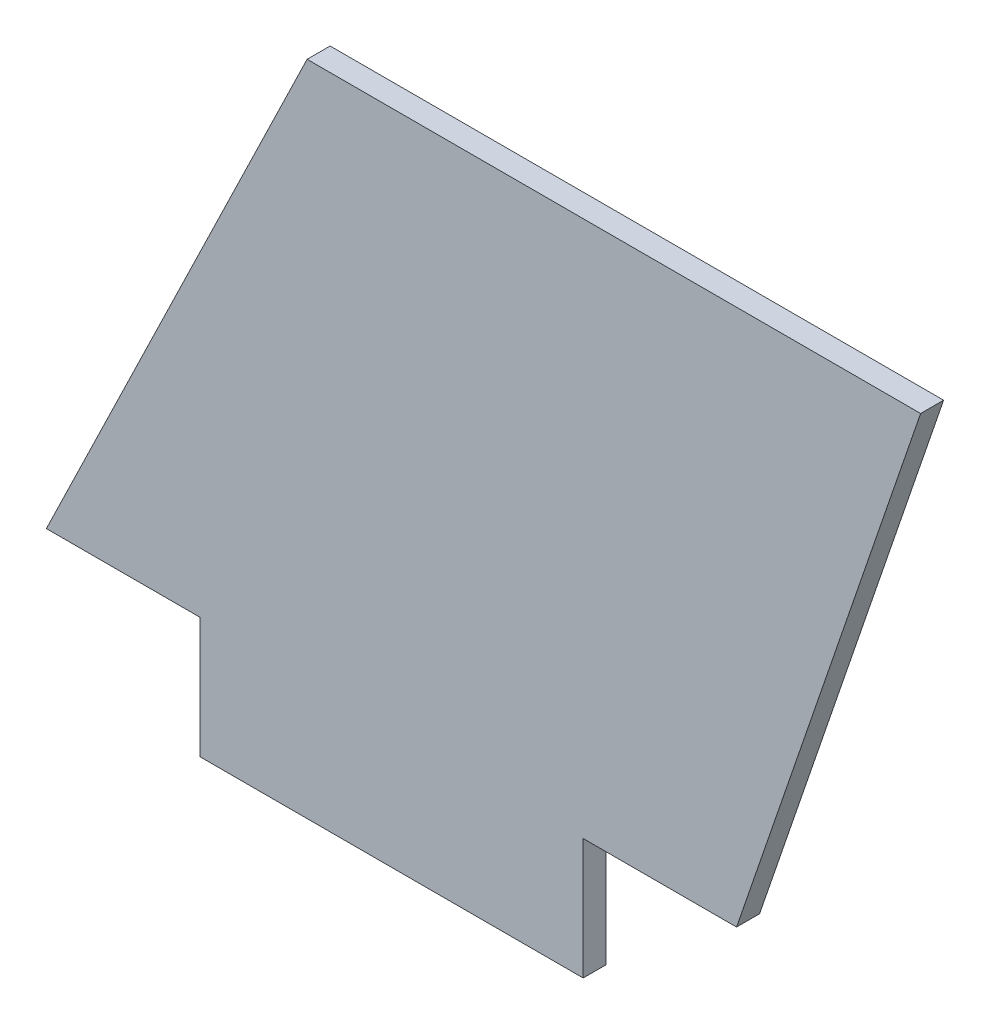
ISO-10303-21;
HEADER;
FILE_DESCRIPTION(('STEP AP214'),'2;1');
FILE_NAME('part.step','',(''),(''),'','','');
FILE_SCHEMA(('AUTOMOTIVE_DESIGN { 1 0 10303 214 1 1 1 1 }'));
ENDSEC;
DATA;
#1=APPLICATION_CONTEXT('core data for automotive mechanical design processes');
#2=APPLICATION_PROTOCOL_DEFINITION('international standard','automotive_design',2000,#1);
#3=PRODUCT_CONTEXT('',#1,'mechanical');
#4=PRODUCT('Part','Part','',(#3));
#5=PRODUCT_RELATED_PRODUCT_CATEGORY('part','',(#4));
#6=PRODUCT_DEFINITION_FORMATION('','',#4);
#7=PRODUCT_DEFINITION_CONTEXT('part definition',#1,'design');
#8=PRODUCT_DEFINITION('design','',#6,#7);
#9=PRODUCT_DEFINITION_SHAPE('','',#8);
#10=(LENGTH_UNIT() NAMED_UNIT(*) SI_UNIT(.MILLI.,.METRE.));
#11=(NAMED_UNIT(*) PLANE_ANGLE_UNIT() SI_UNIT($,.RADIAN.));
#12=(NAMED_UNIT(*) SI_UNIT($,.STERADIAN.) SOLID_ANGLE_UNIT());
#13=UNCERTAINTY_MEASURE_WITH_UNIT(LENGTH_MEASURE(1.E-05),#10,'distance_accuracy_value','');
#14=(GEOMETRIC_REPRESENTATION_CONTEXT(3) GLOBAL_UNCERTAINTY_ASSIGNED_CONTEXT((#13)) GLOBAL_UNIT_ASSIGNED_CONTEXT((#10,
#11,#12)) REPRESENTATION_CONTEXT('',''));
#15=CARTESIAN_POINT('',(0.,0.,0.));
#16=DIRECTION('',(0.,0.,1.));
#17=DIRECTION('',(1.,0.,0.));
#18=AXIS2_PLACEMENT_3D('',#15,#16,#17);
#19=CARTESIAN_POINT('',(17.,35.,1.5));
#20=DIRECTION('',(0.899508158575998,-0.436903962736913,0.));
#21=DIRECTION('',(0.436903962736913,0.899508158575998,0.));
#22=AXIS2_PLACEMENT_3D('',#19,#20,#21);
#23=PLANE('',#22);
#24=DIRECTION('',(-0.436903962736913,-0.899508158575998,0.));
#25=VECTOR('',#24,1.);
#26=CARTESIAN_POINT('',(17.,35.,0.));
#27=LINE('',#26,#25);
#28=CARTESIAN_POINT('',(17.,35.,0.));
#29=VERTEX_POINT('',#28);
#30=CARTESIAN_POINT('',(0.,0.,0.));
#31=VERTEX_POINT('',#30);
#32=EDGE_CURVE('E129',#29,#31,#27,.T.);
#33=ORIENTED_EDGE('',*,*,#32,.T.);
#34=DIRECTION('',(0.,0.,-1.));
#35=VECTOR('',#34,1.);
#36=CARTESIAN_POINT('',(0.,0.,1.5));
#37=LINE('',#36,#35);
#38=CARTESIAN_POINT('',(0.,0.,1.5));
#39=VERTEX_POINT('',#38);
#40=EDGE_CURVE('E11',#39,#31,#37,.T.);
#41=ORIENTED_EDGE('',*,*,#40,.F.);
#42=DIRECTION('',(-0.436903962736913,-0.899508158575998,0.));
#43=VECTOR('',#42,1.);
#44=CARTESIAN_POINT('',(17.,35.,1.5));
#45=LINE('',#44,#43);
#46=CARTESIAN_POINT('',(17.,35.,1.5));
#47=VERTEX_POINT('',#46);
#48=EDGE_CURVE('E143',#47,#39,#45,.T.);
#49=ORIENTED_EDGE('',*,*,#48,.F.);
#50=DIRECTION('',(0.,0.,-1.));
#51=VECTOR('',#50,1.);
#52=CARTESIAN_POINT('',(17.,35.,1.5));
#53=LINE('',#52,#51);
#54=EDGE_CURVE('E125',#47,#29,#53,.T.);
#55=ORIENTED_EDGE('',*,*,#54,.T.);
#56=EDGE_LOOP('',(#33,#41,#49,#55));
#57=FACE_BOUND('',#56,.T.);
#58=ADVANCED_FACE('F33',(#57),#23,.F.);
#59=CARTESIAN_POINT('',(0.,0.,1.5));
#60=DIRECTION('',(0.,1.,0.));
#61=DIRECTION('',(0.,0.,1.));
#62=AXIS2_PLACEMENT_3D('',#59,#60,#61);
#63=PLANE('',#62);
#64=DIRECTION('',(1.,0.,0.));
#65=VECTOR('',#64,1.);
#66=CARTESIAN_POINT('',(0.,0.,0.));
#67=LINE('',#66,#65);
#68=CARTESIAN_POINT('',(9.99999999999999,0.,0.));
#69=VERTEX_POINT('',#68);
#70=EDGE_CURVE('E132',#31,#69,#67,.T.);
#71=ORIENTED_EDGE('',*,*,#70,.T.);
#72=DIRECTION('',(0.,0.,-1.));
#73=VECTOR('',#72,1.);
#74=CARTESIAN_POINT('',(9.99999999999999,0.,1.5));
#75=LINE('',#74,#73);
#76=CARTESIAN_POINT('',(9.99999999999999,0.,1.5));
#77=VERTEX_POINT('',#76);
#78=EDGE_CURVE('E41',#77,#69,#75,.T.);
#79=ORIENTED_EDGE('',*,*,#78,.F.);
#80=DIRECTION('',(1.,0.,0.));
#81=VECTOR('',#80,1.);
#82=CARTESIAN_POINT('',(0.,0.,1.5));
#83=LINE('',#82,#81);
#84=EDGE_CURVE('E92',#39,#77,#83,.T.);
#85=ORIENTED_EDGE('',*,*,#84,.F.);
#86=ORIENTED_EDGE('',*,*,#40,.T.);
#87=EDGE_LOOP('',(#71,#79,#85,#86));
#88=FACE_BOUND('',#87,.T.);
#89=ADVANCED_FACE('F178',(#88),#63,.F.);
#90=CARTESIAN_POINT('',(9.99999999999999,0.,1.5));
#91=DIRECTION('',(1.,0.,0.));
#92=DIRECTION('',(0.,1.,0.));
#93=AXIS2_PLACEMENT_3D('',#90,#91,#92);
#94=PLANE('',#93);
#95=DIRECTION('',(0.,-1.,0.));
#96=VECTOR('',#95,1.);
#97=CARTESIAN_POINT('',(9.99999999999999,0.,0.));
#98=LINE('',#97,#96);
#99=CARTESIAN_POINT('',(9.99999999999999,-7.875,0.));
#100=VERTEX_POINT('',#99);
#101=EDGE_CURVE('E134',#69,#100,#98,.T.);
#102=ORIENTED_EDGE('',*,*,#101,.T.);
#103=DIRECTION('',(0.,0.,-1.));
#104=VECTOR('',#103,1.);
#105=CARTESIAN_POINT('',(9.99999999999999,-7.875,1.5));
#106=LINE('',#105,#104);
#107=CARTESIAN_POINT('',(9.99999999999999,-7.875,1.5));
#108=VERTEX_POINT('',#107);
#109=EDGE_CURVE('E150',#108,#100,#106,.T.);
#110=ORIENTED_EDGE('',*,*,#109,.F.);
#111=DIRECTION('',(0.,-1.,0.));
#112=VECTOR('',#111,1.);
#113=CARTESIAN_POINT('',(9.99999999999999,0.,1.5));
#114=LINE('',#113,#112);
#115=EDGE_CURVE('E158',#77,#108,#114,.T.);
#116=ORIENTED_EDGE('',*,*,#115,.F.);
#117=ORIENTED_EDGE('',*,*,#78,.T.);
#118=EDGE_LOOP('',(#102,#110,#116,#117));
#119=FACE_BOUND('',#118,.T.);
#120=ADVANCED_FACE('F156',(#119),#94,.F.);
#121=CARTESIAN_POINT('',(9.99999999999999,-7.875,1.5));
#122=DIRECTION('',(0.,1.,0.));
#123=DIRECTION('',(0.,0.,1.));
#124=AXIS2_PLACEMENT_3D('',#121,#122,#123);
#125=PLANE('',#124);
#126=DIRECTION('',(1.,0.,0.));
#127=VECTOR('',#126,1.);
#128=CARTESIAN_POINT('',(9.99999999999999,-7.875,0.));
#129=LINE('',#128,#127);
#130=CARTESIAN_POINT('',(35.,-7.875,0.));
#131=VERTEX_POINT('',#130);
#132=EDGE_CURVE('E136',#100,#131,#129,.T.);
#133=ORIENTED_EDGE('',*,*,#132,.T.);
#134=DIRECTION('',(0.,0.,-1.));
#135=VECTOR('',#134,1.);
#136=CARTESIAN_POINT('',(35.,-7.875,1.5));
#137=LINE('',#136,#135);
#138=CARTESIAN_POINT('',(35.,-7.875,1.5));
#139=VERTEX_POINT('',#138);
#140=EDGE_CURVE('E147',#139,#131,#137,.T.);
#141=ORIENTED_EDGE('',*,*,#140,.F.);
#142=DIRECTION('',(1.,0.,0.));
#143=VECTOR('',#142,1.);
#144=CARTESIAN_POINT('',(9.99999999999999,-7.875,1.5));
#145=LINE('',#144,#143);
#146=EDGE_CURVE('E170',#108,#139,#145,.T.);
#147=ORIENTED_EDGE('',*,*,#146,.F.);
#148=ORIENTED_EDGE('',*,*,#109,.T.);
#149=EDGE_LOOP('',(#133,#141,#147,#148));
#150=FACE_BOUND('',#149,.T.);
#151=ADVANCED_FACE('F166',(#150),#125,.F.);
#152=CARTESIAN_POINT('',(35.,-7.875,1.5));
#153=DIRECTION('',(-1.,0.,0.));
#154=DIRECTION('',(0.,0.,1.));
#155=AXIS2_PLACEMENT_3D('',#152,#153,#154);
#156=PLANE('',#155);
#157=DIRECTION('',(0.,1.,0.));
#158=VECTOR('',#157,1.);
#159=CARTESIAN_POINT('',(35.,-7.875,0.));
#160=LINE('',#159,#158);
#161=CARTESIAN_POINT('',(35.,0.,0.));
#162=VERTEX_POINT('',#161);
#163=EDGE_CURVE('E138',#131,#162,#160,.T.);
#164=ORIENTED_EDGE('',*,*,#163,.T.);
#165=DIRECTION('',(0.,0.,-1.));
#166=VECTOR('',#165,1.);
#167=CARTESIAN_POINT('',(35.,0.,1.5));
#168=LINE('',#167,#166);
#169=CARTESIAN_POINT('',(35.,0.,1.5));
#170=VERTEX_POINT('',#169);
#171=EDGE_CURVE('E120',#170,#162,#168,.T.);
#172=ORIENTED_EDGE('',*,*,#171,.F.);
#173=DIRECTION('',(0.,1.,0.));
#174=VECTOR('',#173,1.);
#175=CARTESIAN_POINT('',(35.,-7.875,1.5));
#176=LINE('',#175,#174);
#177=EDGE_CURVE('E111',#139,#170,#176,.T.);
#178=ORIENTED_EDGE('',*,*,#177,.F.);
#179=ORIENTED_EDGE('',*,*,#140,.T.);
#180=EDGE_LOOP('',(#164,#172,#178,#179));
#181=FACE_BOUND('',#180,.T.);
#182=ADVANCED_FACE('F169',(#181),#156,.F.);
#183=CARTESIAN_POINT('',(35.,0.,1.5));
#184=DIRECTION('',(0.,1.,0.));
#185=DIRECTION('',(0.,0.,1.));
#186=AXIS2_PLACEMENT_3D('',#183,#184,#185);
#187=PLANE('',#186);
#188=DIRECTION('',(1.,0.,0.));
#189=VECTOR('',#188,1.);
#190=CARTESIAN_POINT('',(35.,0.,0.));
#191=LINE('',#190,#189);
#192=CARTESIAN_POINT('',(45.,0.,0.));
#193=VERTEX_POINT('',#192);
#194=EDGE_CURVE('E119',#162,#193,#191,.T.);
#195=ORIENTED_EDGE('',*,*,#194,.T.);
#196=DIRECTION('',(0.,0.,-1.));
#197=VECTOR('',#196,1.);
#198=CARTESIAN_POINT('',(45.,0.,1.5));
#199=LINE('',#198,#197);
#200=CARTESIAN_POINT('',(45.,0.,1.5));
#201=VERTEX_POINT('',#200);
#202=EDGE_CURVE('E116',#201,#193,#199,.T.);
#203=ORIENTED_EDGE('',*,*,#202,.F.);
#204=DIRECTION('',(1.,0.,0.));
#205=VECTOR('',#204,1.);
#206=CARTESIAN_POINT('',(35.,0.,1.5));
#207=LINE('',#206,#205);
#208=EDGE_CURVE('E105',#170,#201,#207,.T.);
#209=ORIENTED_EDGE('',*,*,#208,.F.);
#210=ORIENTED_EDGE('',*,*,#171,.T.);
#211=EDGE_LOOP('',(#195,#203,#209,#210));
#212=FACE_BOUND('',#211,.T.);
#213=ADVANCED_FACE('F117',(#212),#187,.F.);
#214=CARTESIAN_POINT('',(45.,0.,1.5));
#215=DIRECTION('',(-0.945945945945946,0.324324324324324,0.));
#216=DIRECTION('',(-0.324324324324324,-0.945945945945946,0.));
#217=AXIS2_PLACEMENT_3D('',#214,#215,#216);
#218=PLANE('',#217);
#219=DIRECTION('',(0.324324324324324,0.945945945945946,0.));
#220=VECTOR('',#219,1.);
#221=CARTESIAN_POINT('',(45.,0.,0.));
#222=LINE('',#221,#220);
#223=CARTESIAN_POINT('',(57.,35.,0.));
#224=VERTEX_POINT('',#223);
#225=EDGE_CURVE('E78',#193,#224,#222,.T.);
#226=ORIENTED_EDGE('',*,*,#225,.T.);
#227=DIRECTION('',(0.,0.,-1.));
#228=VECTOR('',#227,1.);
#229=CARTESIAN_POINT('',(57.,35.,1.5));
#230=LINE('',#229,#228);
#231=CARTESIAN_POINT('',(57.,35.,1.5));
#232=VERTEX_POINT('',#231);
#233=EDGE_CURVE('E121',#232,#224,#230,.T.);
#234=ORIENTED_EDGE('',*,*,#233,.F.);
#235=DIRECTION('',(0.324324324324324,0.945945945945946,0.));
#236=VECTOR('',#235,1.);
#237=CARTESIAN_POINT('',(45.,0.,1.5));
#238=LINE('',#237,#236);
#239=EDGE_CURVE('E109',#201,#232,#238,.T.);
#240=ORIENTED_EDGE('',*,*,#239,.F.);
#241=ORIENTED_EDGE('',*,*,#202,.T.);
#242=EDGE_LOOP('',(#226,#234,#240,#241));
#243=FACE_BOUND('',#242,.T.);
#244=ADVANCED_FACE('F123',(#243),#218,.F.);
#245=CARTESIAN_POINT('',(57.,35.,1.5));
#246=DIRECTION('',(0.,-1.,0.));
#247=DIRECTION('',(1.,0.,0.));
#248=AXIS2_PLACEMENT_3D('',#245,#246,#247);
#249=PLANE('',#248);
#250=DIRECTION('',(-1.,0.,0.));
#251=VECTOR('',#250,1.);
#252=CARTESIAN_POINT('',(57.,35.,0.));
#253=LINE('',#252,#251);
#254=EDGE_CURVE('E84',#224,#29,#253,.T.);
#255=ORIENTED_EDGE('',*,*,#254,.T.);
#256=ORIENTED_EDGE('',*,*,#54,.F.);
#257=DIRECTION('',(-1.,0.,0.));
#258=VECTOR('',#257,1.);
#259=CARTESIAN_POINT('',(57.,35.,1.5));
#260=LINE('',#259,#258);
#261=EDGE_CURVE('E49',#232,#47,#260,.T.);
#262=ORIENTED_EDGE('',*,*,#261,.F.);
#263=ORIENTED_EDGE('',*,*,#233,.T.);
#264=EDGE_LOOP('',(#255,#256,#262,#263));
#265=FACE_BOUND('',#264,.T.);
#266=ADVANCED_FACE('F194',(#265),#249,.F.);
#267=CARTESIAN_POINT('',(0.,0.,1.5));
#268=DIRECTION('',(0.,0.,1.));
#269=DIRECTION('',(1.,0.,0.));
#270=AXIS2_PLACEMENT_3D('',#267,#268,#269);
#271=PLANE('',#270);
#272=ORIENTED_EDGE('',*,*,#48,.T.);
#273=ORIENTED_EDGE('',*,*,#84,.T.);
#274=ORIENTED_EDGE('',*,*,#115,.T.);
#275=ORIENTED_EDGE('',*,*,#146,.T.);
#276=ORIENTED_EDGE('',*,*,#177,.T.);
#277=ORIENTED_EDGE('',*,*,#208,.T.);
#278=ORIENTED_EDGE('',*,*,#239,.T.);
#279=ORIENTED_EDGE('',*,*,#261,.T.);
#280=EDGE_LOOP('',(#272,#273,#274,#275,#276,#277,#278,#279));
#281=FACE_BOUND('',#280,.T.);
#282=ADVANCED_FACE('F107',(#281),#271,.T.);
#283=CARTESIAN_POINT('',(0.,0.,0.));
#284=DIRECTION('',(0.,0.,1.));
#285=DIRECTION('',(1.,0.,0.));
#286=AXIS2_PLACEMENT_3D('',#283,#284,#285);
#287=PLANE('',#286);
#288=ORIENTED_EDGE('',*,*,#32,.F.);
#289=ORIENTED_EDGE('',*,*,#254,.F.);
#290=ORIENTED_EDGE('',*,*,#225,.F.);
#291=ORIENTED_EDGE('',*,*,#194,.F.);
#292=ORIENTED_EDGE('',*,*,#163,.F.);
#293=ORIENTED_EDGE('',*,*,#132,.F.);
#294=ORIENTED_EDGE('',*,*,#101,.F.);
#295=ORIENTED_EDGE('',*,*,#70,.F.);
#296=EDGE_LOOP('',(#288,#289,#290,#291,#292,#293,#294,#295));
#297=FACE_BOUND('',#296,.T.);
#298=ADVANCED_FACE('F162',(#297),#287,.F.);
#299=CLOSED_SHELL('',(#58,#89,#120,#151,#182,#213,#244,#266,#282,#298));
#300=MANIFOLD_SOLID_BREP('B2',#299);
#301=ADVANCED_BREP_SHAPE_REPRESENTATION('',(#18,#300),#14);
#302=SHAPE_DEFINITION_REPRESENTATION(#9,#301);
ENDSEC;
END-ISO-10303-21;
